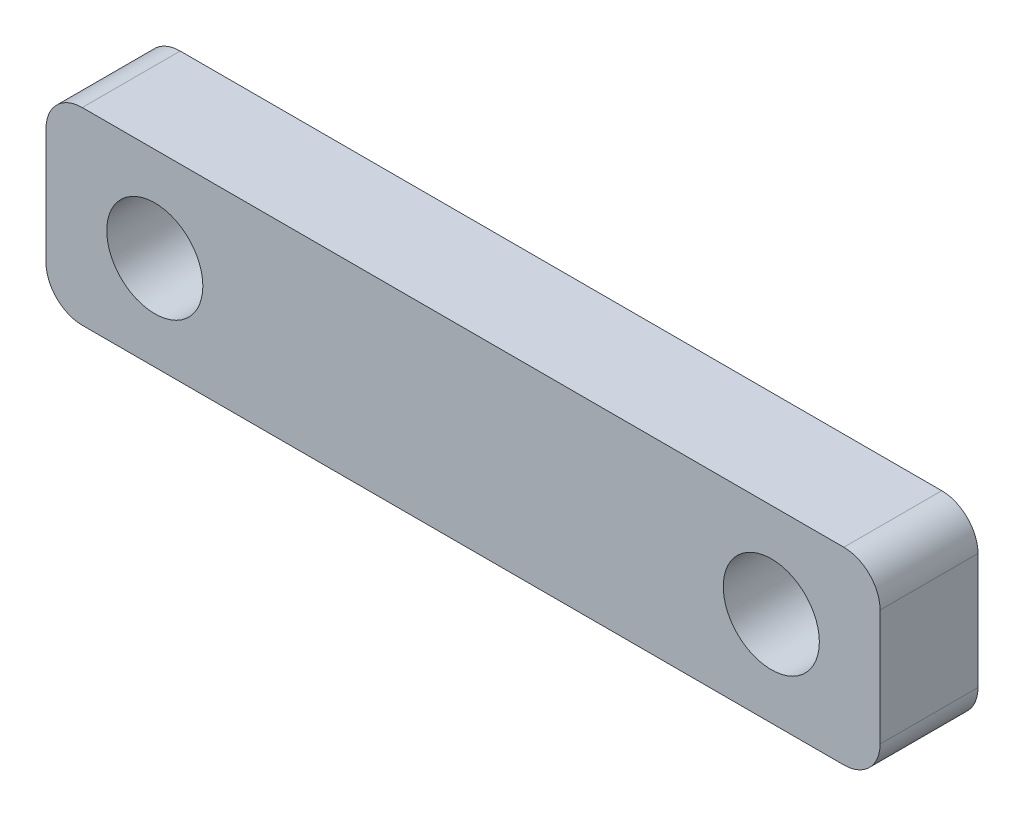
ISO-10303-21;
HEADER;
FILE_DESCRIPTION(('STEP AP214'),'2;1');
FILE_NAME('part.step','',(''),(''),'','','');
FILE_SCHEMA(('AUTOMOTIVE_DESIGN { 1 0 10303 214 1 1 1 1 }'));
ENDSEC;
DATA;
#1=APPLICATION_CONTEXT('core data for automotive mechanical design processes');
#2=APPLICATION_PROTOCOL_DEFINITION('international standard','automotive_design',2000,#1);
#3=PRODUCT_CONTEXT('',#1,'mechanical');
#4=PRODUCT('Part','Part','',(#3));
#5=PRODUCT_RELATED_PRODUCT_CATEGORY('part','',(#4));
#6=PRODUCT_DEFINITION_FORMATION('','',#4);
#7=PRODUCT_DEFINITION_CONTEXT('part definition',#1,'design');
#8=PRODUCT_DEFINITION('design','',#6,#7);
#9=PRODUCT_DEFINITION_SHAPE('','',#8);
#10=(LENGTH_UNIT() NAMED_UNIT(*) SI_UNIT(.MILLI.,.METRE.));
#11=(NAMED_UNIT(*) PLANE_ANGLE_UNIT() SI_UNIT($,.RADIAN.));
#12=(NAMED_UNIT(*) SI_UNIT($,.STERADIAN.) SOLID_ANGLE_UNIT());
#13=UNCERTAINTY_MEASURE_WITH_UNIT(LENGTH_MEASURE(1.E-05),#10,'distance_accuracy_value','');
#14=(GEOMETRIC_REPRESENTATION_CONTEXT(3) GLOBAL_UNCERTAINTY_ASSIGNED_CONTEXT((#13)) GLOBAL_UNIT_ASSIGNED_CONTEXT((#10,
#11,#12)) REPRESENTATION_CONTEXT('',''));
#15=CARTESIAN_POINT('',(0.,0.,0.));
#16=DIRECTION('',(0.,0.,1.));
#17=DIRECTION('',(1.,0.,0.));
#18=AXIS2_PLACEMENT_3D('',#15,#16,#17);
#19=CARTESIAN_POINT('',(0.,0.,2.7));
#20=DIRECTION('',(0.,0.,1.));
#21=DIRECTION('',(1.,0.,0.));
#22=AXIS2_PLACEMENT_3D('',#19,#20,#21);
#23=PLANE('',#22);
#24=CARTESIAN_POINT('',(-8.5,0.,2.7));
#25=DIRECTION('',(0.,0.,1.));
#26=DIRECTION('',(1.,0.,0.));
#27=AXIS2_PLACEMENT_3D('',#24,#25,#26);
#28=CIRCLE('',#27,1.325);
#29=CARTESIAN_POINT('',(-7.175,0.,2.7));
#30=VERTEX_POINT('',#29);
#31=EDGE_CURVE('E181',#30,#30,#28,.T.);
#32=ORIENTED_EDGE('',*,*,#31,.F.);
#33=EDGE_LOOP('',(#32));
#34=FACE_BOUND('',#33,.T.);
#35=DIRECTION('',(-1.,0.,0.));
#36=VECTOR('',#35,1.);
#37=CARTESIAN_POINT('',(-11.5,2.6,2.7));
#38=LINE('',#37,#36);
#39=CARTESIAN_POINT('',(10.5,2.6,2.7));
#40=VERTEX_POINT('',#39);
#41=CARTESIAN_POINT('',(-10.5,2.6,2.7));
#42=VERTEX_POINT('',#41);
#43=EDGE_CURVE('E176',#40,#42,#38,.T.);
#44=ORIENTED_EDGE('',*,*,#43,.T.);
#45=CARTESIAN_POINT('',(-10.5,1.6,2.7));
#46=DIRECTION('',(0.,0.,1.));
#47=DIRECTION('',(1.,0.,0.));
#48=AXIS2_PLACEMENT_3D('',#45,#46,#47);
#49=CIRCLE('',#48,1.);
#50=CARTESIAN_POINT('',(-11.5,1.6,2.7));
#51=VERTEX_POINT('',#50);
#52=EDGE_CURVE('E157',#42,#51,#49,.T.);
#53=ORIENTED_EDGE('',*,*,#52,.T.);
#54=DIRECTION('',(0.,-1.,0.));
#55=VECTOR('',#54,1.);
#56=CARTESIAN_POINT('',(-11.5,2.6,2.7));
#57=LINE('',#56,#55);
#58=CARTESIAN_POINT('',(-11.5,-1.6,2.7));
#59=VERTEX_POINT('',#58);
#60=EDGE_CURVE('E127',#51,#59,#57,.T.);
#61=ORIENTED_EDGE('',*,*,#60,.T.);
#62=CARTESIAN_POINT('',(-10.5,-1.6,2.7));
#63=DIRECTION('',(0.,0.,1.));
#64=DIRECTION('',(1.,0.,0.));
#65=AXIS2_PLACEMENT_3D('',#62,#63,#64);
#66=CIRCLE('',#65,1.);
#67=CARTESIAN_POINT('',(-10.5,-2.6,2.7));
#68=VERTEX_POINT('',#67);
#69=EDGE_CURVE('E63',#59,#68,#66,.T.);
#70=ORIENTED_EDGE('',*,*,#69,.T.);
#71=DIRECTION('',(1.,0.,0.));
#72=VECTOR('',#71,1.);
#73=CARTESIAN_POINT('',(-11.5,-2.6,2.7));
#74=LINE('',#73,#72);
#75=CARTESIAN_POINT('',(10.5,-2.6,2.7));
#76=VERTEX_POINT('',#75);
#77=EDGE_CURVE('E143',#68,#76,#74,.T.);
#78=ORIENTED_EDGE('',*,*,#77,.T.);
#79=CARTESIAN_POINT('',(10.5,-1.6,2.7));
#80=DIRECTION('',(0.,0.,1.));
#81=DIRECTION('',(1.,0.,0.));
#82=AXIS2_PLACEMENT_3D('',#79,#80,#81);
#83=CIRCLE('',#82,1.);
#84=CARTESIAN_POINT('',(11.5,-1.6,2.7));
#85=VERTEX_POINT('',#84);
#86=EDGE_CURVE('E154',#76,#85,#83,.T.);
#87=ORIENTED_EDGE('',*,*,#86,.T.);
#88=DIRECTION('',(0.,1.,0.));
#89=VECTOR('',#88,1.);
#90=CARTESIAN_POINT('',(11.5,2.6,2.7));
#91=LINE('',#90,#89);
#92=CARTESIAN_POINT('',(11.5,1.6,2.7));
#93=VERTEX_POINT('',#92);
#94=EDGE_CURVE('E137',#85,#93,#91,.T.);
#95=ORIENTED_EDGE('',*,*,#94,.T.);
#96=CARTESIAN_POINT('',(10.5,1.6,2.7));
#97=DIRECTION('',(0.,0.,1.));
#98=DIRECTION('',(1.,0.,0.));
#99=AXIS2_PLACEMENT_3D('',#96,#97,#98);
#100=CIRCLE('',#99,1.);
#101=EDGE_CURVE('E152',#93,#40,#100,.T.);
#102=ORIENTED_EDGE('',*,*,#101,.T.);
#103=EDGE_LOOP('',(#44,#53,#61,#70,#78,#87,#95,#102));
#104=FACE_BOUND('',#103,.T.);
#105=CARTESIAN_POINT('',(8.5,0.,2.7));
#106=DIRECTION('',(0.,0.,1.));
#107=DIRECTION('',(1.,0.,0.));
#108=AXIS2_PLACEMENT_3D('',#105,#106,#107);
#109=CIRCLE('',#108,1.325);
#110=CARTESIAN_POINT('',(9.825,0.,2.7));
#111=VERTEX_POINT('',#110);
#112=EDGE_CURVE('E190',#111,#111,#109,.T.);
#113=ORIENTED_EDGE('',*,*,#112,.F.);
#114=EDGE_LOOP('',(#113));
#115=FACE_BOUND('',#114,.T.);
#116=ADVANCED_FACE('F41',(#34,#104,#115),#23,.T.);
#117=CARTESIAN_POINT('',(0.,0.,0.));
#118=DIRECTION('',(0.,0.,1.));
#119=DIRECTION('',(1.,0.,0.));
#120=AXIS2_PLACEMENT_3D('',#117,#118,#119);
#121=PLANE('',#120);
#122=DIRECTION('',(0.,-1.,0.));
#123=VECTOR('',#122,1.);
#124=CARTESIAN_POINT('',(-11.5,2.6,0.));
#125=LINE('',#124,#123);
#126=CARTESIAN_POINT('',(-11.5,1.6,0.));
#127=VERTEX_POINT('',#126);
#128=CARTESIAN_POINT('',(-11.5,-1.6,0.));
#129=VERTEX_POINT('',#128);
#130=EDGE_CURVE('E125',#127,#129,#125,.T.);
#131=ORIENTED_EDGE('',*,*,#130,.F.);
#132=CARTESIAN_POINT('',(-10.5,1.6,0.));
#133=DIRECTION('',(0.,0.,1.));
#134=DIRECTION('',(1.,0.,0.));
#135=AXIS2_PLACEMENT_3D('',#132,#133,#134);
#136=CIRCLE('',#135,1.);
#137=CARTESIAN_POINT('',(-10.5,2.6,0.));
#138=VERTEX_POINT('',#137);
#139=EDGE_CURVE('E108',#127,#138,#136,.F.);
#140=ORIENTED_EDGE('',*,*,#139,.T.);
#141=DIRECTION('',(-1.,0.,0.));
#142=VECTOR('',#141,1.);
#143=CARTESIAN_POINT('',(-11.5,2.6,0.));
#144=LINE('',#143,#142);
#145=CARTESIAN_POINT('',(10.5,2.6,0.));
#146=VERTEX_POINT('',#145);
#147=EDGE_CURVE('E135',#146,#138,#144,.T.);
#148=ORIENTED_EDGE('',*,*,#147,.F.);
#149=CARTESIAN_POINT('',(10.5,1.6,0.));
#150=DIRECTION('',(0.,0.,1.));
#151=DIRECTION('',(1.,0.,0.));
#152=AXIS2_PLACEMENT_3D('',#149,#150,#151);
#153=CIRCLE('',#152,1.);
#154=CARTESIAN_POINT('',(11.5,1.6,0.));
#155=VERTEX_POINT('',#154);
#156=EDGE_CURVE('E128',#146,#155,#153,.F.);
#157=ORIENTED_EDGE('',*,*,#156,.T.);
#158=DIRECTION('',(0.,1.,0.));
#159=VECTOR('',#158,1.);
#160=CARTESIAN_POINT('',(11.5,2.6,0.));
#161=LINE('',#160,#159);
#162=CARTESIAN_POINT('',(11.5,-1.6,0.));
#163=VERTEX_POINT('',#162);
#164=EDGE_CURVE('E139',#163,#155,#161,.T.);
#165=ORIENTED_EDGE('',*,*,#164,.F.);
#166=CARTESIAN_POINT('',(10.5,-1.6,0.));
#167=DIRECTION('',(0.,0.,1.));
#168=DIRECTION('',(1.,0.,0.));
#169=AXIS2_PLACEMENT_3D('',#166,#167,#168);
#170=CIRCLE('',#169,1.);
#171=CARTESIAN_POINT('',(10.5,-2.6,0.));
#172=VERTEX_POINT('',#171);
#173=EDGE_CURVE('E146',#163,#172,#170,.F.);
#174=ORIENTED_EDGE('',*,*,#173,.T.);
#175=DIRECTION('',(1.,0.,0.));
#176=VECTOR('',#175,1.);
#177=CARTESIAN_POINT('',(-11.5,-2.6,0.));
#178=LINE('',#177,#176);
#179=CARTESIAN_POINT('',(-10.5,-2.6,0.));
#180=VERTEX_POINT('',#179);
#181=EDGE_CURVE('E134',#180,#172,#178,.T.);
#182=ORIENTED_EDGE('',*,*,#181,.F.);
#183=CARTESIAN_POINT('',(-10.5,-1.6,0.));
#184=DIRECTION('',(0.,0.,1.));
#185=DIRECTION('',(1.,0.,0.));
#186=AXIS2_PLACEMENT_3D('',#183,#184,#185);
#187=CIRCLE('',#186,1.);
#188=EDGE_CURVE('E119',#180,#129,#187,.F.);
#189=ORIENTED_EDGE('',*,*,#188,.T.);
#190=EDGE_LOOP('',(#131,#140,#148,#157,#165,#174,#182,#189));
#191=FACE_BOUND('',#190,.T.);
#192=CARTESIAN_POINT('',(-8.5,0.,0.));
#193=DIRECTION('',(0.,0.,1.));
#194=DIRECTION('',(1.,0.,0.));
#195=AXIS2_PLACEMENT_3D('',#192,#193,#194);
#196=CIRCLE('',#195,1.325);
#197=CARTESIAN_POINT('',(-7.175,0.,0.));
#198=VERTEX_POINT('',#197);
#199=EDGE_CURVE('E183',#198,#198,#196,.T.);
#200=ORIENTED_EDGE('',*,*,#199,.T.);
#201=EDGE_LOOP('',(#200));
#202=FACE_BOUND('',#201,.T.);
#203=CARTESIAN_POINT('',(8.5,0.,0.));
#204=DIRECTION('',(0.,0.,1.));
#205=DIRECTION('',(1.,0.,0.));
#206=AXIS2_PLACEMENT_3D('',#203,#204,#205);
#207=CIRCLE('',#206,1.325);
#208=CARTESIAN_POINT('',(9.825,0.,0.));
#209=VERTEX_POINT('',#208);
#210=EDGE_CURVE('E192',#209,#209,#207,.T.);
#211=ORIENTED_EDGE('',*,*,#210,.T.);
#212=EDGE_LOOP('',(#211));
#213=FACE_BOUND('',#212,.T.);
#214=ADVANCED_FACE('F131',(#191,#202,#213),#121,.F.);
#215=CARTESIAN_POINT('',(11.5,2.6,2.7));
#216=DIRECTION('',(-1.,0.,0.));
#217=DIRECTION('',(0.,0.,1.));
#218=AXIS2_PLACEMENT_3D('',#215,#216,#217);
#219=PLANE('',#218);
#220=ORIENTED_EDGE('',*,*,#94,.F.);
#221=DIRECTION('',(0.,0.,-1.));
#222=VECTOR('',#221,1.);
#223=CARTESIAN_POINT('',(11.5,-1.6,2.7));
#224=LINE('',#223,#222);
#225=EDGE_CURVE('E11',#85,#163,#224,.T.);
#226=ORIENTED_EDGE('',*,*,#225,.T.);
#227=ORIENTED_EDGE('',*,*,#164,.T.);
#228=DIRECTION('',(0.,0.,-1.));
#229=VECTOR('',#228,1.);
#230=CARTESIAN_POINT('',(11.5,1.6,2.7));
#231=LINE('',#230,#229);
#232=EDGE_CURVE('E49',#155,#93,#231,.F.);
#233=ORIENTED_EDGE('',*,*,#232,.T.);
#234=EDGE_LOOP('',(#220,#226,#227,#233));
#235=FACE_BOUND('',#234,.T.);
#236=ADVANCED_FACE('F167',(#235),#219,.F.);
#237=CARTESIAN_POINT('',(-11.5,2.6,2.7));
#238=DIRECTION('',(0.,-1.,0.));
#239=DIRECTION('',(0.,0.,-1.));
#240=AXIS2_PLACEMENT_3D('',#237,#238,#239);
#241=PLANE('',#240);
#242=ORIENTED_EDGE('',*,*,#147,.T.);
#243=DIRECTION('',(0.,0.,-1.));
#244=VECTOR('',#243,1.);
#245=CARTESIAN_POINT('',(-10.5,2.6,2.7));
#246=LINE('',#245,#244);
#247=EDGE_CURVE('E113',#138,#42,#246,.F.);
#248=ORIENTED_EDGE('',*,*,#247,.T.);
#249=ORIENTED_EDGE('',*,*,#43,.F.);
#250=DIRECTION('',(0.,0.,-1.));
#251=VECTOR('',#250,1.);
#252=CARTESIAN_POINT('',(10.5,2.6,2.7));
#253=LINE('',#252,#251);
#254=EDGE_CURVE('E118',#40,#146,#253,.T.);
#255=ORIENTED_EDGE('',*,*,#254,.T.);
#256=EDGE_LOOP('',(#242,#248,#249,#255));
#257=FACE_BOUND('',#256,.T.);
#258=ADVANCED_FACE('F180',(#257),#241,.F.);
#259=CARTESIAN_POINT('',(-11.5,2.6,2.7));
#260=DIRECTION('',(1.,0.,0.));
#261=DIRECTION('',(0.,0.,-1.));
#262=AXIS2_PLACEMENT_3D('',#259,#260,#261);
#263=PLANE('',#262);
#264=ORIENTED_EDGE('',*,*,#60,.F.);
#265=DIRECTION('',(0.,0.,-1.));
#266=VECTOR('',#265,1.);
#267=CARTESIAN_POINT('',(-11.5,1.6,2.7));
#268=LINE('',#267,#266);
#269=EDGE_CURVE('E112',#51,#127,#268,.T.);
#270=ORIENTED_EDGE('',*,*,#269,.T.);
#271=ORIENTED_EDGE('',*,*,#130,.T.);
#272=DIRECTION('',(0.,0.,-1.));
#273=VECTOR('',#272,1.);
#274=CARTESIAN_POINT('',(-11.5,-1.6,2.7));
#275=LINE('',#274,#273);
#276=EDGE_CURVE('E129',#129,#59,#275,.F.);
#277=ORIENTED_EDGE('',*,*,#276,.T.);
#278=EDGE_LOOP('',(#264,#270,#271,#277));
#279=FACE_BOUND('',#278,.T.);
#280=ADVANCED_FACE('F124',(#279),#263,.F.);
#281=CARTESIAN_POINT('',(-11.5,-2.6,2.7));
#282=DIRECTION('',(0.,1.,0.));
#283=DIRECTION('',(0.,0.,1.));
#284=AXIS2_PLACEMENT_3D('',#281,#282,#283);
#285=PLANE('',#284);
#286=ORIENTED_EDGE('',*,*,#77,.F.);
#287=DIRECTION('',(0.,0.,-1.));
#288=VECTOR('',#287,1.);
#289=CARTESIAN_POINT('',(-10.5,-2.6,2.7));
#290=LINE('',#289,#288);
#291=EDGE_CURVE('E160',#68,#180,#290,.T.);
#292=ORIENTED_EDGE('',*,*,#291,.T.);
#293=ORIENTED_EDGE('',*,*,#181,.T.);
#294=DIRECTION('',(0.,0.,-1.));
#295=VECTOR('',#294,1.);
#296=CARTESIAN_POINT('',(10.5,-2.6,2.7));
#297=LINE('',#296,#295);
#298=EDGE_CURVE('E56',#172,#76,#297,.F.);
#299=ORIENTED_EDGE('',*,*,#298,.T.);
#300=EDGE_LOOP('',(#286,#292,#293,#299));
#301=FACE_BOUND('',#300,.T.);
#302=ADVANCED_FACE('F212',(#301),#285,.F.);
#303=CARTESIAN_POINT('',(-8.5,0.,2.7));
#304=DIRECTION('',(0.,0.,-1.));
#305=DIRECTION('',(-1.,0.,0.));
#306=AXIS2_PLACEMENT_3D('',#303,#304,#305);
#307=CYLINDRICAL_SURFACE('',#306,1.325);
#308=ORIENTED_EDGE('',*,*,#31,.T.);
#309=EDGE_LOOP('',(#308));
#310=FACE_BOUND('',#309,.T.);
#311=ORIENTED_EDGE('',*,*,#199,.F.);
#312=EDGE_LOOP('',(#311));
#313=FACE_BOUND('',#312,.T.);
#314=ADVANCED_FACE('F209',(#310,#313),#307,.F.);
#315=CARTESIAN_POINT('',(8.5,0.,2.7));
#316=DIRECTION('',(0.,0.,-1.));
#317=DIRECTION('',(-1.,0.,0.));
#318=AXIS2_PLACEMENT_3D('',#315,#316,#317);
#319=CYLINDRICAL_SURFACE('',#318,1.325);
#320=ORIENTED_EDGE('',*,*,#112,.T.);
#321=EDGE_LOOP('',(#320));
#322=FACE_BOUND('',#321,.T.);
#323=ORIENTED_EDGE('',*,*,#210,.F.);
#324=EDGE_LOOP('',(#323));
#325=FACE_BOUND('',#324,.T.);
#326=ADVANCED_FACE('F198',(#322,#325),#319,.F.);
#327=CARTESIAN_POINT('',(-10.5,1.6,2.7));
#328=DIRECTION('',(0.,0.,-1.));
#329=DIRECTION('',(-1.,0.,0.));
#330=AXIS2_PLACEMENT_3D('',#327,#328,#329);
#331=CYLINDRICAL_SURFACE('',#330,1.);
#332=ORIENTED_EDGE('',*,*,#52,.F.);
#333=ORIENTED_EDGE('',*,*,#247,.F.);
#334=ORIENTED_EDGE('',*,*,#139,.F.);
#335=ORIENTED_EDGE('',*,*,#269,.F.);
#336=EDGE_LOOP('',(#332,#333,#334,#335));
#337=FACE_BOUND('',#336,.T.);
#338=ADVANCED_FACE('F111',(#337),#331,.T.);
#339=CARTESIAN_POINT('',(-10.5,-1.6,2.7));
#340=DIRECTION('',(0.,0.,-1.));
#341=DIRECTION('',(-1.,0.,0.));
#342=AXIS2_PLACEMENT_3D('',#339,#340,#341);
#343=CYLINDRICAL_SURFACE('',#342,1.);
#344=ORIENTED_EDGE('',*,*,#69,.F.);
#345=ORIENTED_EDGE('',*,*,#276,.F.);
#346=ORIENTED_EDGE('',*,*,#188,.F.);
#347=ORIENTED_EDGE('',*,*,#291,.F.);
#348=EDGE_LOOP('',(#344,#345,#346,#347));
#349=FACE_BOUND('',#348,.T.);
#350=ADVANCED_FACE('F223',(#349),#343,.T.);
#351=CARTESIAN_POINT('',(10.5,-1.6,2.7));
#352=DIRECTION('',(0.,0.,-1.));
#353=DIRECTION('',(-1.,0.,0.));
#354=AXIS2_PLACEMENT_3D('',#351,#352,#353);
#355=CYLINDRICAL_SURFACE('',#354,1.);
#356=ORIENTED_EDGE('',*,*,#86,.F.);
#357=ORIENTED_EDGE('',*,*,#298,.F.);
#358=ORIENTED_EDGE('',*,*,#173,.F.);
#359=ORIENTED_EDGE('',*,*,#225,.F.);
#360=EDGE_LOOP('',(#356,#357,#358,#359));
#361=FACE_BOUND('',#360,.T.);
#362=ADVANCED_FACE('F225',(#361),#355,.T.);
#363=CARTESIAN_POINT('',(10.5,1.6,2.7));
#364=DIRECTION('',(0.,0.,-1.));
#365=DIRECTION('',(-1.,0.,0.));
#366=AXIS2_PLACEMENT_3D('',#363,#364,#365);
#367=CYLINDRICAL_SURFACE('',#366,1.);
#368=ORIENTED_EDGE('',*,*,#101,.F.);
#369=ORIENTED_EDGE('',*,*,#232,.F.);
#370=ORIENTED_EDGE('',*,*,#156,.F.);
#371=ORIENTED_EDGE('',*,*,#254,.F.);
#372=EDGE_LOOP('',(#368,#369,#370,#371));
#373=FACE_BOUND('',#372,.T.);
#374=ADVANCED_FACE('F43',(#373),#367,.T.);
#375=CLOSED_SHELL('',(#116,#214,#236,#258,#280,#302,#314,#326,#338,#350,#362,#374));
#376=MANIFOLD_SOLID_BREP('B2',#375);
#377=ADVANCED_BREP_SHAPE_REPRESENTATION('',(#18,#376),#14);
#378=SHAPE_DEFINITION_REPRESENTATION(#9,#377);
ENDSEC;
END-ISO-10303-21;
